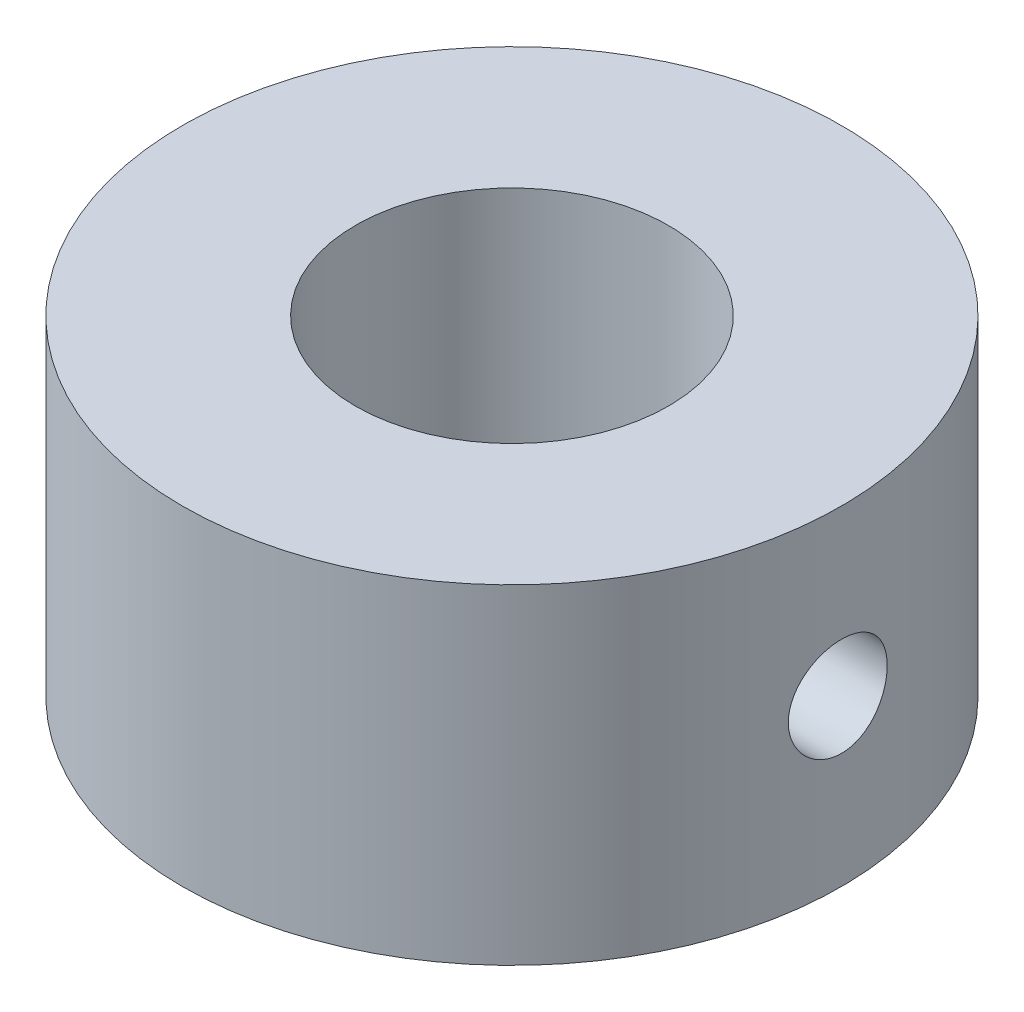
ISO-10303-21;
HEADER;
FILE_DESCRIPTION(('STEP AP214'),'2;1');
FILE_NAME('part.step','',(''),(''),'','','');
FILE_SCHEMA(('AUTOMOTIVE_DESIGN { 1 0 10303 214 1 1 1 1 }'));
ENDSEC;
DATA;
#1=APPLICATION_CONTEXT('core data for automotive mechanical design processes');
#2=APPLICATION_PROTOCOL_DEFINITION('international standard','automotive_design',2000,#1);
#3=PRODUCT_CONTEXT('',#1,'mechanical');
#4=PRODUCT('Part','Part','',(#3));
#5=PRODUCT_RELATED_PRODUCT_CATEGORY('part','',(#4));
#6=PRODUCT_DEFINITION_FORMATION('','',#4);
#7=PRODUCT_DEFINITION_CONTEXT('part definition',#1,'design');
#8=PRODUCT_DEFINITION('design','',#6,#7);
#9=PRODUCT_DEFINITION_SHAPE('','',#8);
#10=(LENGTH_UNIT() NAMED_UNIT(*) SI_UNIT(.MILLI.,.METRE.));
#11=(NAMED_UNIT(*) PLANE_ANGLE_UNIT() SI_UNIT($,.RADIAN.));
#12=(NAMED_UNIT(*) SI_UNIT($,.STERADIAN.) SOLID_ANGLE_UNIT());
#13=UNCERTAINTY_MEASURE_WITH_UNIT(LENGTH_MEASURE(1.E-05),#10,'distance_accuracy_value','');
#14=(GEOMETRIC_REPRESENTATION_CONTEXT(3) GLOBAL_UNCERTAINTY_ASSIGNED_CONTEXT((#13)) GLOBAL_UNIT_ASSIGNED_CONTEXT((#10,
#11,#12)) REPRESENTATION_CONTEXT('',''));
#15=CARTESIAN_POINT('',(0.,0.,0.));
#16=DIRECTION('',(0.,0.,1.));
#17=DIRECTION('',(1.,0.,0.));
#18=AXIS2_PLACEMENT_3D('',#15,#16,#17);
#19=CARTESIAN_POINT('',(0.,10.,0.));
#20=DIRECTION('',(0.,1.,0.));
#21=DIRECTION('',(0.,0.,1.));
#22=AXIS2_PLACEMENT_3D('',#19,#20,#21);
#23=PLANE('',#22);
#24=CARTESIAN_POINT('',(0.,10.,0.));
#25=DIRECTION('',(0.,1.,0.));
#26=DIRECTION('',(0.,0.,1.));
#27=AXIS2_PLACEMENT_3D('',#24,#25,#26);
#28=CIRCLE('',#27,10.);
#29=CARTESIAN_POINT('',(0.,10.,10.));
#30=VERTEX_POINT('',#29);
#31=EDGE_CURVE('E10',#30,#30,#28,.T.);
#32=ORIENTED_EDGE('',*,*,#31,.T.);
#33=EDGE_LOOP('',(#32));
#34=FACE_BOUND('',#33,.T.);
#35=CARTESIAN_POINT('',(0.,10.,0.));
#36=DIRECTION('',(0.,1.,0.));
#37=DIRECTION('',(0.,0.,1.));
#38=AXIS2_PLACEMENT_3D('',#35,#36,#37);
#39=CIRCLE('',#38,4.75);
#40=CARTESIAN_POINT('',(0.,10.,4.75));
#41=VERTEX_POINT('',#40);
#42=EDGE_CURVE('E53',#41,#41,#39,.T.);
#43=ORIENTED_EDGE('',*,*,#42,.F.);
#44=EDGE_LOOP('',(#43));
#45=FACE_BOUND('',#44,.T.);
#46=ADVANCED_FACE('F34',(#34,#45),#23,.T.);
#47=CARTESIAN_POINT('',(0.,0.,0.));
#48=DIRECTION('',(0.,1.,0.));
#49=DIRECTION('',(0.,0.,1.));
#50=AXIS2_PLACEMENT_3D('',#47,#48,#49);
#51=PLANE('',#50);
#52=CARTESIAN_POINT('',(0.,0.,0.));
#53=DIRECTION('',(0.,1.,0.));
#54=DIRECTION('',(0.,0.,1.));
#55=AXIS2_PLACEMENT_3D('',#52,#53,#54);
#56=CIRCLE('',#55,10.);
#57=CARTESIAN_POINT('',(0.,0.,10.));
#58=VERTEX_POINT('',#57);
#59=EDGE_CURVE('E48',#58,#58,#56,.T.);
#60=ORIENTED_EDGE('',*,*,#59,.F.);
#61=EDGE_LOOP('',(#60));
#62=FACE_BOUND('',#61,.T.);
#63=CARTESIAN_POINT('',(0.,0.,0.));
#64=DIRECTION('',(0.,1.,0.));
#65=DIRECTION('',(0.,0.,1.));
#66=AXIS2_PLACEMENT_3D('',#63,#64,#65);
#67=CIRCLE('',#66,4.75);
#68=CARTESIAN_POINT('',(0.,0.,4.75));
#69=VERTEX_POINT('',#68);
#70=EDGE_CURVE('E55',#69,#69,#67,.T.);
#71=ORIENTED_EDGE('',*,*,#70,.T.);
#72=EDGE_LOOP('',(#71));
#73=FACE_BOUND('',#72,.T.);
#74=ADVANCED_FACE('F76',(#62,#73),#51,.F.);
#75=CARTESIAN_POINT('',(0.,10.,0.));
#76=DIRECTION('',(0.,-1.,0.));
#77=DIRECTION('',(0.,0.,-1.));
#78=AXIS2_PLACEMENT_3D('',#75,#76,#77);
#79=CYLINDRICAL_SURFACE('',#78,10.);
#80=CARTESIAN_POINT('',(9.88685996664259,5.,-1.5));
#81=CARTESIAN_POINT('',(9.88686136668593,4.91625443071005,-1.49999654107284));
#82=CARTESIAN_POINT('',(9.88793551739101,4.83246024924929,-1.49296296388491));
#83=CARTESIAN_POINT('',(9.8921131480324,4.66721468511687,-1.46502196657001));
#84=CARTESIAN_POINT('',(9.8952186073143,4.58576566851999,-1.44410101402628));
#85=CARTESIAN_POINT('',(9.90309938986228,4.4276262445531,-1.38902526098084));
#86=CARTESIAN_POINT('',(9.90787343131536,4.35093223745784,-1.35488061681397));
#87=CARTESIAN_POINT('',(9.91855194113145,4.20437296922792,-1.27435063087791));
#88=CARTESIAN_POINT('',(9.92445625383668,4.1345067697857,-1.22796697429872));
#89=CARTESIAN_POINT('',(9.9367828924804,4.00301618324567,-1.12387902418558));
#90=CARTESIAN_POINT('',(9.94320862458057,3.94145438659326,-1.0660960558482));
#91=CARTESIAN_POINT('',(9.95582368169047,3.8288625143445,-0.941019605444373));
#92=CARTESIAN_POINT('',(9.96201299368615,3.77783301783301,-0.873725600786529));
#93=CARTESIAN_POINT('',(9.97349347428185,3.68752336830864,-0.731136358052745));
#94=CARTESIAN_POINT('',(9.97878018435569,3.64830084967754,-0.655804227365766));
#95=CARTESIAN_POINT('',(9.98782206746405,3.58308840119182,-0.499528850106974));
#96=CARTESIAN_POINT('',(9.99157732141945,3.55709777215711,-0.418585900270677));
#97=CARTESIAN_POINT('',(9.99710914797782,3.51927661146916,-0.254031123090569));
#98=CARTESIAN_POINT('',(9.99890035887344,3.50734127361284,-0.170443884389866));
#99=CARTESIAN_POINT('',(10.0003524476958,3.4976440651751,-0.00243520401947892));
#100=CARTESIAN_POINT('',(10.0000134440494,3.49988140668031,0.0819861910157463));
#101=CARTESIAN_POINT('',(9.99725499660796,3.51838333776243,0.24855171820052));
#102=CARTESIAN_POINT('',(9.99485227652479,3.53453517179148,0.330708691400008));
#103=CARTESIAN_POINT('',(9.98825500227851,3.58023060632258,0.491132829143137));
#104=CARTESIAN_POINT('',(9.98406040199739,3.60977455150144,0.569399893513482));
#105=CARTESIAN_POINT('',(9.97432193873206,3.68153099691709,0.720163780770317));
#106=CARTESIAN_POINT('',(9.96877303515638,3.72379096510874,0.792637672323596));
#107=CARTESIAN_POINT('',(9.95694438245421,3.81974519366999,0.929507907150178));
#108=CARTESIAN_POINT('',(9.95066458523184,3.87344020670687,0.993903718271736));
#109=CARTESIAN_POINT('',(9.93800158192627,3.99136844882659,1.11345448272265));
#110=CARTESIAN_POINT('',(9.93161796623257,4.05570012197011,1.16851232950947));
#111=CARTESIAN_POINT('',(9.91952704453523,4.19274107712373,1.26706599338813));
#112=CARTESIAN_POINT('',(9.91381974269649,4.26545041071992,1.31056173927999));
#113=CARTESIAN_POINT('',(9.90372775286855,4.41728396294064,1.38476964534605));
#114=CARTESIAN_POINT('',(9.89934409845291,4.49641313366239,1.41547182270082));
#115=CARTESIAN_POINT('',(9.89241402899059,4.65878525514739,1.46312336208879));
#116=CARTESIAN_POINT('',(9.88986748446299,4.74202791554675,1.48007369337326));
#117=CARTESIAN_POINT('',(9.88692451395027,4.90940008957749,1.49960720086655));
#118=CARTESIAN_POINT('',(9.88650748802574,4.99351318820153,1.50232803265052));
#119=CARTESIAN_POINT('',(9.88781607937153,5.16099419481734,1.49369057019819));
#120=CARTESIAN_POINT('',(9.88954163015778,5.24436212585076,1.48233271282302));
#121=CARTESIAN_POINT('',(9.89492202461453,5.40755981796563,1.44597702952766));
#122=CARTESIAN_POINT('',(9.89856716482858,5.4874052049416,1.42104778527821));
#123=CARTESIAN_POINT('',(9.90736801825768,5.64178409204861,1.35832831947087));
#124=CARTESIAN_POINT('',(9.91252380607176,5.7163173296282,1.32053746276389));
#125=CARTESIAN_POINT('',(9.92381355687063,5.85857326033504,1.23283677995324));
#126=CARTESIAN_POINT('',(9.92995459279988,5.92624044727982,1.18283784561766));
#127=CARTESIAN_POINT('',(9.94250159433355,6.05227285987381,1.07226416837201));
#128=CARTESIAN_POINT('',(9.94890757490292,6.11063755918115,1.0116888274468));
#129=CARTESIAN_POINT('',(9.96132705217386,6.21690260663358,0.881075619628183));
#130=CARTESIAN_POINT('',(9.96733683460423,6.26471172824248,0.810963126771957));
#131=CARTESIAN_POINT('',(9.97822905032016,6.34787290526264,0.663622080263681));
#132=CARTESIAN_POINT('',(9.98311151444563,6.38322530146503,0.586393721360439));
#133=CARTESIAN_POINT('',(9.99118269660795,6.44032374248803,0.427297995861147));
#134=CARTESIAN_POINT('',(9.99437761717899,6.46211966707836,0.345448858754303));
#135=CARTESIAN_POINT('',(9.99873976656896,6.49164787953747,0.179200815501194));
#136=CARTESIAN_POINT('',(9.99990712930801,6.49938109624914,0.0948020781305813));
#137=CARTESIAN_POINT('',(10.0000812905914,6.5005417045494,-0.0732645908608179));
#138=CARTESIAN_POINT('',(9.99910917023796,6.49410868087698,-0.156931570212051));
#139=CARTESIAN_POINT('',(9.99515610519141,6.46741861157924,-0.321979795323106));
#140=CARTESIAN_POINT('',(9.99217516692666,6.44716161019144,-0.403361048396512));
#141=CARTESIAN_POINT('',(9.98453786742463,6.39344812442976,-0.56148937437966));
#142=CARTESIAN_POINT('',(9.97988273316947,6.36000130486107,-0.638239793148782));
#143=CARTESIAN_POINT('',(9.96940834495499,6.28087251201686,-0.785061117896602));
#144=CARTESIAN_POINT('',(9.96358905320338,6.23519014151966,-0.855131806920708));
#145=CARTESIAN_POINT('',(9.95136510636178,6.13238230117083,-0.987312585191958));
#146=CARTESIAN_POINT('',(9.94495548425942,6.07515377418366,-1.04934206644638));
#147=CARTESIAN_POINT('',(9.93231001689001,5.95109492691953,-1.16296808390268));
#148=CARTESIAN_POINT('',(9.92607421276291,5.88426235617565,-1.21456216798984));
#149=CARTESIAN_POINT('',(9.91444484029116,5.74245101676747,-1.30611310822974));
#150=CARTESIAN_POINT('',(9.90905620156985,5.66742858297817,-1.34600294291209));
#151=CARTESIAN_POINT('',(9.89978909110724,5.5117032232367,-1.41255613872045));
#152=CARTESIAN_POINT('',(9.89590905307931,5.43100629214218,-1.43923322574897));
#153=CARTESIAN_POINT('',(9.89099485524825,5.29162256374353,-1.47254951890026));
#154=CARTESIAN_POINT('',(9.88945249382379,5.23379660307573,-1.4828276978042));
#155=CARTESIAN_POINT('',(9.88738456567011,5.11732170826565,-1.49655410576574));
#156=CARTESIAN_POINT('',(9.88685898576155,5.05867278480039,-1.50000242335076));
#157=CARTESIAN_POINT('',(9.88685996664259,5.,-1.5));
#158=B_SPLINE_CURVE_WITH_KNOTS('',3,(#80,#81,#82,#83,#84,#85,#86,#87,#88,#89,#90,#91,#92,#93,
#94,#95,#96,#97,#98,#99,#100,#101,#102,#103,#104,#105,#106,#107,#108,#109,#110,#111,#112,#113,
#114,#115,#116,#117,#118,#119,#120,#121,#122,#123,#124,#125,#126,#127,#128,#129,#130,#131,#132,
#133,#134,#135,#136,#137,#138,#139,#140,#141,#142,#143,#144,#145,#146,#147,#148,#149,#150,#151,
#152,#153,#154,#155,#156,#157),.UNSPECIFIED.,.T.,.F.,(4,2,2,2,2,2,2,2,2,2,2,2,2,2,2,2,2,2,2,2,2,
2,2,2,2,2,2,2,2,2,2,2,2,2,2,2,2,2,4),(0.,0.251022251804869,0.502289469561802,0.753364085335675,
1.00440414866133,1.25724158649108,1.51009292207817,1.76415922105782,2.01821209364501,
2.27035832534397,2.52249053939374,2.77259862515728,3.02271314839401,3.27377316386454,
3.52484970949272,3.77839544666269,4.0319427451435,4.28568751773139,4.53941440444341,
4.79068214603744,5.04194209099918,5.29194394807374,5.54195815286117,5.79385486001302,
6.04576581461802,6.29977537753516,6.55377799071854,6.8068404089109,7.05988611170473,
7.31044963622326,7.56101235892823,7.81139182257833,8.06177941567106,8.31450950010969,
8.56729890236862,8.82150878824931,9.07545403445563,9.25132441891613,9.42719252376192),.UNSPECIFIED.);
#159=CARTESIAN_POINT('',(9.88685996664259,5.,-1.5));
#160=VERTEX_POINT('',#159);
#161=EDGE_CURVE('E58',#160,#160,#158,.T.);
#162=ORIENTED_EDGE('',*,*,#161,.T.);
#163=EDGE_LOOP('',(#162));
#164=FACE_BOUND('',#163,.T.);
#165=ORIENTED_EDGE('',*,*,#31,.F.);
#166=EDGE_LOOP('',(#165));
#167=FACE_BOUND('',#166,.T.);
#168=ORIENTED_EDGE('',*,*,#59,.T.);
#169=EDGE_LOOP('',(#168));
#170=FACE_BOUND('',#169,.T.);
#171=ADVANCED_FACE('F36',(#164,#167,#170),#79,.T.);
#172=CARTESIAN_POINT('',(0.,10.,0.));
#173=DIRECTION('',(0.,-1.,0.));
#174=DIRECTION('',(0.,0.,-1.));
#175=AXIS2_PLACEMENT_3D('',#172,#173,#174);
#176=CYLINDRICAL_SURFACE('',#175,4.75);
#177=CARTESIAN_POINT('',(4.50693909432999,5.,-1.5));
#178=CARTESIAN_POINT('',(4.50693949515469,4.91803171732386,-1.49999958004515));
#179=CARTESIAN_POINT('',(4.50919970874085,4.83605901627526,-1.49325840231682));
#180=CARTESIAN_POINT('',(4.5179553253781,4.67452499050055,-1.46655104887094));
#181=CARTESIAN_POINT('',(4.52445180182028,4.59496428227732,-1.44658152131253));
#182=CARTESIAN_POINT('',(4.54087234787262,4.44061779715047,-1.39417508352591));
#183=CARTESIAN_POINT('',(4.55079024986066,4.36582371318849,-1.36176059537411));
#184=CARTESIAN_POINT('',(4.57292751994247,4.22271394399535,-1.28545946652237));
#185=CARTESIAN_POINT('',(4.58514731070763,4.15439945201203,-1.24157071835092));
#186=CARTESIAN_POINT('',(4.6109923380212,4.02379132854794,-1.14191784971278));
#187=CARTESIAN_POINT('',(4.62464992232587,3.96175843626409,-1.08582030493755));
#188=CARTESIAN_POINT('',(4.65155671093151,3.84780564717649,-0.964055421977067));
#189=CARTESIAN_POINT('',(4.66480585671778,3.79588719379636,-0.89838672023377));
#190=CARTESIAN_POINT('',(4.68977365915903,3.70248149387462,-0.757464836701734));
#191=CARTESIAN_POINT('',(4.70144979545653,3.66126348829665,-0.682025001056138));
#192=CARTESIAN_POINT('',(4.72157773016225,3.59220274277542,-0.524852067423557));
#193=CARTESIAN_POINT('',(4.73003030329318,3.56435678869385,-0.443120487221092));
#194=CARTESIAN_POINT('',(4.74252974850081,3.52370326889888,-0.278414775826808));
#195=CARTESIAN_POINT('',(4.74670693307633,3.51044989854394,-0.195560751143444));
#196=CARTESIAN_POINT('',(4.75064554540298,3.49794449590243,-0.0287067286102966));
#197=CARTESIAN_POINT('',(4.75040799755164,3.49868921548992,0.0552929988694206));
#198=CARTESIAN_POINT('',(4.74563427350171,3.51386719955588,0.218913619351864));
#199=CARTESIAN_POINT('',(4.74124990899214,3.52781704971685,0.298584494979865));
#200=CARTESIAN_POINT('',(4.72886249486103,3.56821515765042,0.45439031175481));
#201=CARTESIAN_POINT('',(4.72085920760149,3.59466423619499,0.530525020335842));
#202=CARTESIAN_POINT('',(4.70193103559911,3.65961618188483,0.678203652675078));
#203=CARTESIAN_POINT('',(4.69097118266663,3.69826432767598,0.74967901329581));
#204=CARTESIAN_POINT('',(4.6672824986712,3.78640031458714,0.885279102378908));
#205=CARTESIAN_POINT('',(4.65455321340063,3.83589094082225,0.949401935733848));
#206=CARTESIAN_POINT('',(4.62803989727125,3.94678196623492,1.07135837440922));
#207=CARTESIAN_POINT('',(4.61423403233704,4.00859923405259,1.12880871974839));
#208=CARTESIAN_POINT('',(4.58758892442481,4.14111815897915,1.23264301054731));
#209=CARTESIAN_POINT('',(4.57474980051078,4.2118209075726,1.2790255944206));
#210=CARTESIAN_POINT('',(4.55138024059369,4.36120677183125,1.35986638692084));
#211=CARTESIAN_POINT('',(4.54087839223385,4.4399731386161,1.39417963639867));
#212=CARTESIAN_POINT('',(4.5237069894911,4.60257810171561,1.44893342452635));
#213=CARTESIAN_POINT('',(4.51703602366211,4.68641481731664,1.46937907304313));
#214=CARTESIAN_POINT('',(4.5085959379324,4.85310236032391,1.49507161979024));
#215=CARTESIAN_POINT('',(4.50663729609299,4.93585300367877,1.50090655288536));
#216=CARTESIAN_POINT('',(4.50731687465408,5.10115771596648,1.49886513965521));
#217=CARTESIAN_POINT('',(4.50995436623754,5.18371181398727,1.49099096720734));
#218=CARTESIAN_POINT('',(4.51934163323602,5.34372668789747,1.46228084598242));
#219=CARTESIAN_POINT('',(4.5259668251803,5.42126592066695,1.4418371919129));
#220=CARTESIAN_POINT('',(4.54245022183902,5.57180393247881,1.38903056686353));
#221=CARTESIAN_POINT('',(4.55230896114271,5.64480195836622,1.35666562487664));
#222=CARTESIAN_POINT('',(4.57450539166734,5.78654170372151,1.2798587413425));
#223=CARTESIAN_POINT('',(4.58690698850857,5.85509722827386,1.2350921421442));
#224=CARTESIAN_POINT('',(4.61266077618539,5.98393704575857,1.13512998682984));
#225=CARTESIAN_POINT('',(4.62601321856053,6.0442191375734,1.07993166463934));
#226=CARTESIAN_POINT('',(4.65285013455169,6.15744177660799,0.957886037531118));
#227=CARTESIAN_POINT('',(4.66631614662306,6.20996198288841,0.890643665109766));
#228=CARTESIAN_POINT('',(4.6912975579683,6.30299130819133,0.747973360630615));
#229=CARTESIAN_POINT('',(4.70281304406929,6.34350096192049,0.672545793179843));
#230=CARTESIAN_POINT('',(4.72253168708172,6.41097236253163,0.516099288450847));
#231=CARTESIAN_POINT('',(4.73075845435933,6.43803103178452,0.435125281433142));
#232=CARTESIAN_POINT('',(4.7430763734001,6.478053044343,0.269469399491867));
#233=CARTESIAN_POINT('',(4.74716884950256,6.49102090146525,0.184788721002361));
#234=CARTESIAN_POINT('',(4.7506674317259,6.50212030326586,0.0179886485878241));
#235=CARTESIAN_POINT('',(4.75026513795577,6.50085840271502,-0.0640868361538644));
#236=CARTESIAN_POINT('',(4.74528029002946,6.48500545466395,-0.226803220963032));
#237=CARTESIAN_POINT('',(4.74069801830655,6.47041530772828,-0.307444217580877));
#238=CARTESIAN_POINT('',(4.72793024704182,6.42870894005712,-0.463969836764499));
#239=CARTESIAN_POINT('',(4.71979237633648,6.4017580672524,-0.53990267277431));
#240=CARTESIAN_POINT('',(4.70075227796057,6.33624514340539,-0.686204345183071));
#241=CARTESIAN_POINT('',(4.68984957149724,6.29768108106414,-0.756572215112847));
#242=CARTESIAN_POINT('',(4.66594837362514,6.20850268052653,-0.892382156713932));
#243=CARTESIAN_POINT('',(4.65289067194133,6.15751932859434,-0.957571386267191));
#244=CARTESIAN_POINT('',(4.62631837968684,6.04559678750154,-1.07867009763973));
#245=CARTESIAN_POINT('',(4.61280365200013,5.9846545891106,-1.13457676425287));
#246=CARTESIAN_POINT('',(4.5863001606644,5.85205855722786,-1.23744612372159));
#247=CARTESIAN_POINT('',(4.57334496349761,5.78011070174193,-1.28403955823579));
#248=CARTESIAN_POINT('',(4.55001145096037,5.62901394327933,-1.36442560849337));
#249=CARTESIAN_POINT('',(4.53963214845841,5.54986781475499,-1.39822313048984));
#250=CARTESIAN_POINT('',(4.52342799882926,5.39305354742876,-1.44974900503547));
#251=CARTESIAN_POINT('',(4.51730787458817,5.3157635541421,-1.46853682069789));
#252=CARTESIAN_POINT('',(4.50906374742014,5.15898337414743,-1.4936609032698));
#253=CARTESIAN_POINT('',(4.50693870560567,5.07949376488828,-1.50000040727695));
#254=CARTESIAN_POINT('',(4.50693909432999,5.,-1.5));
#255=B_SPLINE_CURVE_WITH_KNOTS('',3,(#177,#178,#179,#180,#181,#182,#183,#184,#185,#186,#187,
#188,#189,#190,#191,#192,#193,#194,#195,#196,#197,#198,#199,#200,#201,#202,#203,#204,#205,#206,
#207,#208,#209,#210,#211,#212,#213,#214,#215,#216,#217,#218,#219,#220,#221,#222,#223,#224,#225,
#226,#227,#228,#229,#230,#231,#232,#233,#234,#235,#236,#237,#238,#239,#240,#241,#242,#243,#244,
#245,#246,#247,#248,#249,#250,#251,#252,#253,#254),.UNSPECIFIED.,.T.,.F.,(4,2,2,2,2,2,2,2,2,2,2,
2,2,2,2,2,2,2,2,2,2,2,2,2,2,2,2,2,2,2,2,2,2,2,2,2,2,2,4),(0.,0.245611090579273,
0.491284438685785,0.736517218845768,0.981795072467575,1.23487733964253,1.48799569757339,
1.74697244897189,2.00588692090239,2.25665093580603,2.50735676398231,2.74922580012767,
2.99111072100683,3.2359924360223,3.48093712787276,3.7362950135404,3.99168429786021,
4.25004385973256,4.50830817072249,4.75599786818586,5.00364829262799,5.24393641423545,
5.48426428174336,5.73160040316639,5.97900220045884,6.23690747266809,6.49480126127746,
6.75080881416402,7.0067343340116,7.25179355317672,7.49683621537552,7.73869250201122,
7.98059070007259,8.23081327027949,8.48111158966216,8.739930558781,8.99865018989115,
9.23690856092584,9.47510496630383),.UNSPECIFIED.);
#256=CARTESIAN_POINT('',(4.50693909432999,5.,-1.5));
#257=VERTEX_POINT('',#256);
#258=EDGE_CURVE('E39',#257,#257,#255,.T.);
#259=ORIENTED_EDGE('',*,*,#258,.F.);
#260=EDGE_LOOP('',(#259));
#261=FACE_BOUND('',#260,.T.);
#262=ORIENTED_EDGE('',*,*,#42,.T.);
#263=EDGE_LOOP('',(#262));
#264=FACE_BOUND('',#263,.T.);
#265=ORIENTED_EDGE('',*,*,#70,.F.);
#266=EDGE_LOOP('',(#265));
#267=FACE_BOUND('',#266,.T.);
#268=ADVANCED_FACE('F68',(#261,#264,#267),#176,.F.);
#269=CARTESIAN_POINT('',(0.,5.,0.));
#270=DIRECTION('',(1.,0.,0.));
#271=DIRECTION('',(0.,0.,-1.));
#272=AXIS2_PLACEMENT_3D('',#269,#270,#271);
#273=CYLINDRICAL_SURFACE('',#272,1.5);
#274=ORIENTED_EDGE('',*,*,#258,.T.);
#275=EDGE_LOOP('',(#274));
#276=FACE_BOUND('',#275,.T.);
#277=ORIENTED_EDGE('',*,*,#161,.F.);
#278=EDGE_LOOP('',(#277));
#279=FACE_BOUND('',#278,.T.);
#280=ADVANCED_FACE('F65',(#276,#279),#273,.F.);
#281=CLOSED_SHELL('',(#46,#74,#171,#268,#280));
#282=MANIFOLD_SOLID_BREP('B2',#281);
#283=ADVANCED_BREP_SHAPE_REPRESENTATION('',(#18,#282),#14);
#284=SHAPE_DEFINITION_REPRESENTATION(#9,#283);
ENDSEC;
END-ISO-10303-21;
